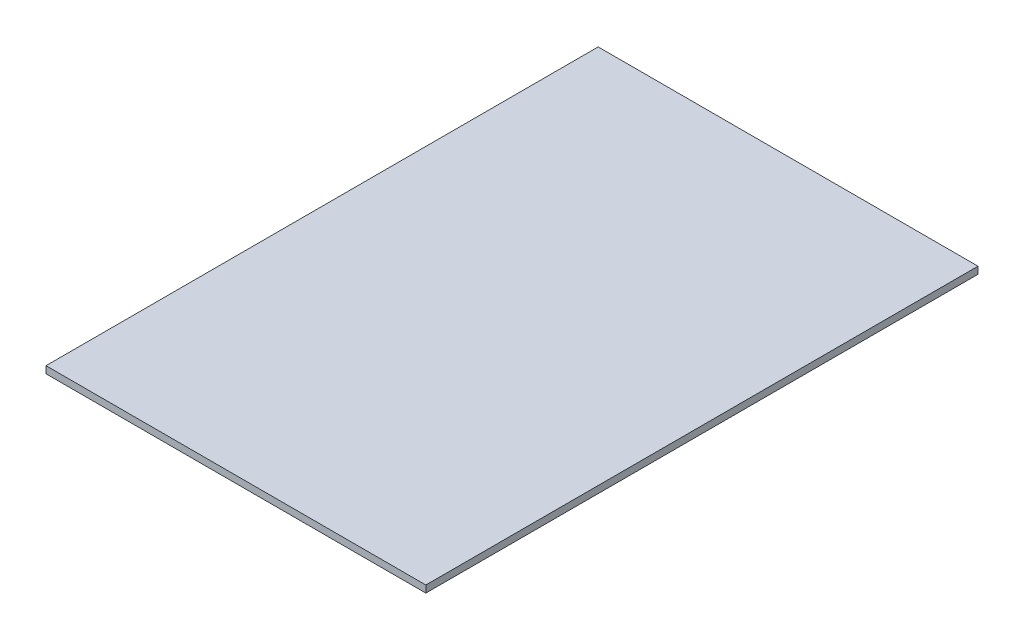
ISO-10303-21;
HEADER;
FILE_DESCRIPTION(('STEP AP214'),'2;1');
FILE_NAME('part.step','',(''),(''),'','','');
FILE_SCHEMA(('AUTOMOTIVE_DESIGN { 1 0 10303 214 1 1 1 1 }'));
ENDSEC;
DATA;
#1=APPLICATION_CONTEXT('core data for automotive mechanical design processes');
#2=APPLICATION_PROTOCOL_DEFINITION('international standard','automotive_design',2000,#1);
#3=PRODUCT_CONTEXT('',#1,'mechanical');
#4=PRODUCT('Part','Part','',(#3));
#5=PRODUCT_RELATED_PRODUCT_CATEGORY('part','',(#4));
#6=PRODUCT_DEFINITION_FORMATION('','',#4);
#7=PRODUCT_DEFINITION_CONTEXT('part definition',#1,'design');
#8=PRODUCT_DEFINITION('design','',#6,#7);
#9=PRODUCT_DEFINITION_SHAPE('','',#8);
#10=(LENGTH_UNIT() NAMED_UNIT(*) SI_UNIT(.MILLI.,.METRE.));
#11=(NAMED_UNIT(*) PLANE_ANGLE_UNIT() SI_UNIT($,.RADIAN.));
#12=(NAMED_UNIT(*) SI_UNIT($,.STERADIAN.) SOLID_ANGLE_UNIT());
#13=UNCERTAINTY_MEASURE_WITH_UNIT(LENGTH_MEASURE(1.E-05),#10,'distance_accuracy_value','');
#14=(GEOMETRIC_REPRESENTATION_CONTEXT(3) GLOBAL_UNCERTAINTY_ASSIGNED_CONTEXT((#13)) GLOBAL_UNIT_ASSIGNED_CONTEXT((#10,
#11,#12)) REPRESENTATION_CONTEXT('',''));
#15=CARTESIAN_POINT('',(0.,0.,0.));
#16=DIRECTION('',(0.,0.,1.));
#17=DIRECTION('',(1.,0.,0.));
#18=AXIS2_PLACEMENT_3D('',#15,#16,#17);
#19=CARTESIAN_POINT('',(-270.,10.,392.5));
#20=DIRECTION('',(0.,0.,-1.));
#21=DIRECTION('',(-1.,0.,0.));
#22=AXIS2_PLACEMENT_3D('',#19,#20,#21);
#23=PLANE('',#22);
#24=DIRECTION('',(1.,0.,0.));
#25=VECTOR('',#24,1.);
#26=CARTESIAN_POINT('',(-270.,0.,392.5));
#27=LINE('',#26,#25);
#28=CARTESIAN_POINT('',(-270.,0.,392.5));
#29=VERTEX_POINT('',#28);
#30=CARTESIAN_POINT('',(270.,0.,392.5));
#31=VERTEX_POINT('',#30);
#32=EDGE_CURVE('E98',#29,#31,#27,.T.);
#33=ORIENTED_EDGE('',*,*,#32,.T.);
#34=DIRECTION('',(0.,-1.,0.));
#35=VECTOR('',#34,1.);
#36=CARTESIAN_POINT('',(270.,10.,392.5));
#37=LINE('',#36,#35);
#38=CARTESIAN_POINT('',(270.,10.,392.5));
#39=VERTEX_POINT('',#38);
#40=EDGE_CURVE('E11',#39,#31,#37,.T.);
#41=ORIENTED_EDGE('',*,*,#40,.F.);
#42=DIRECTION('',(1.,0.,0.));
#43=VECTOR('',#42,1.);
#44=CARTESIAN_POINT('',(-270.,10.,392.5));
#45=LINE('',#44,#43);
#46=CARTESIAN_POINT('',(-270.,10.,392.5));
#47=VERTEX_POINT('',#46);
#48=EDGE_CURVE('E84',#47,#39,#45,.T.);
#49=ORIENTED_EDGE('',*,*,#48,.F.);
#50=DIRECTION('',(0.,-1.,0.));
#51=VECTOR('',#50,1.);
#52=CARTESIAN_POINT('',(-270.,10.,392.5));
#53=LINE('',#52,#51);
#54=EDGE_CURVE('E51',#47,#29,#53,.T.);
#55=ORIENTED_EDGE('',*,*,#54,.T.);
#56=EDGE_LOOP('',(#33,#41,#49,#55));
#57=FACE_BOUND('',#56,.T.);
#58=ADVANCED_FACE('F35',(#57),#23,.F.);
#59=CARTESIAN_POINT('',(270.,10.,392.5));
#60=DIRECTION('',(-1.,0.,0.));
#61=DIRECTION('',(0.,0.,1.));
#62=AXIS2_PLACEMENT_3D('',#59,#60,#61);
#63=PLANE('',#62);
#64=DIRECTION('',(0.,0.,-1.));
#65=VECTOR('',#64,1.);
#66=CARTESIAN_POINT('',(270.,0.,392.5));
#67=LINE('',#66,#65);
#68=CARTESIAN_POINT('',(270.,0.,-392.5));
#69=VERTEX_POINT('',#68);
#70=EDGE_CURVE('E89',#31,#69,#67,.T.);
#71=ORIENTED_EDGE('',*,*,#70,.T.);
#72=DIRECTION('',(0.,-1.,0.));
#73=VECTOR('',#72,1.);
#74=CARTESIAN_POINT('',(270.,10.,-392.5));
#75=LINE('',#74,#73);
#76=CARTESIAN_POINT('',(270.,10.,-392.5));
#77=VERTEX_POINT('',#76);
#78=EDGE_CURVE('E43',#77,#69,#75,.T.);
#79=ORIENTED_EDGE('',*,*,#78,.F.);
#80=DIRECTION('',(0.,0.,-1.));
#81=VECTOR('',#80,1.);
#82=CARTESIAN_POINT('',(270.,10.,392.5));
#83=LINE('',#82,#81);
#84=EDGE_CURVE('E76',#39,#77,#83,.T.);
#85=ORIENTED_EDGE('',*,*,#84,.F.);
#86=ORIENTED_EDGE('',*,*,#40,.T.);
#87=EDGE_LOOP('',(#71,#79,#85,#86));
#88=FACE_BOUND('',#87,.T.);
#89=ADVANCED_FACE('F88',(#88),#63,.F.);
#90=CARTESIAN_POINT('',(-270.,10.,-392.5));
#91=DIRECTION('',(0.,0.,-1.));
#92=DIRECTION('',(-1.,0.,0.));
#93=AXIS2_PLACEMENT_3D('',#90,#91,#92);
#94=PLANE('',#93);
#95=DIRECTION('',(1.,0.,0.));
#96=VECTOR('',#95,1.);
#97=CARTESIAN_POINT('',(-270.,0.,-392.5));
#98=LINE('',#97,#96);
#99=CARTESIAN_POINT('',(-270.,0.,-392.5));
#100=VERTEX_POINT('',#99);
#101=EDGE_CURVE('E101',#100,#69,#98,.T.);
#102=ORIENTED_EDGE('',*,*,#101,.F.);
#103=DIRECTION('',(0.,-1.,0.));
#104=VECTOR('',#103,1.);
#105=CARTESIAN_POINT('',(-270.,10.,-392.5));
#106=LINE('',#105,#104);
#107=CARTESIAN_POINT('',(-270.,10.,-392.5));
#108=VERTEX_POINT('',#107);
#109=EDGE_CURVE('E65',#108,#100,#106,.T.);
#110=ORIENTED_EDGE('',*,*,#109,.F.);
#111=DIRECTION('',(1.,0.,0.));
#112=VECTOR('',#111,1.);
#113=CARTESIAN_POINT('',(-270.,10.,-392.5));
#114=LINE('',#113,#112);
#115=EDGE_CURVE('E83',#108,#77,#114,.T.);
#116=ORIENTED_EDGE('',*,*,#115,.T.);
#117=ORIENTED_EDGE('',*,*,#78,.T.);
#118=EDGE_LOOP('',(#102,#110,#116,#117));
#119=FACE_BOUND('',#118,.T.);
#120=ADVANCED_FACE('F92',(#119),#94,.T.);
#121=CARTESIAN_POINT('',(-270.,10.,392.5));
#122=DIRECTION('',(-1.,0.,0.));
#123=DIRECTION('',(0.,0.,1.));
#124=AXIS2_PLACEMENT_3D('',#121,#122,#123);
#125=PLANE('',#124);
#126=DIRECTION('',(0.,0.,-1.));
#127=VECTOR('',#126,1.);
#128=CARTESIAN_POINT('',(-270.,0.,392.5));
#129=LINE('',#128,#127);
#130=EDGE_CURVE('E103',#29,#100,#129,.T.);
#131=ORIENTED_EDGE('',*,*,#130,.F.);
#132=ORIENTED_EDGE('',*,*,#54,.F.);
#133=DIRECTION('',(0.,0.,-1.));
#134=VECTOR('',#133,1.);
#135=CARTESIAN_POINT('',(-270.,10.,392.5));
#136=LINE('',#135,#134);
#137=EDGE_CURVE('E93',#47,#108,#136,.T.);
#138=ORIENTED_EDGE('',*,*,#137,.T.);
#139=ORIENTED_EDGE('',*,*,#109,.T.);
#140=EDGE_LOOP('',(#131,#132,#138,#139));
#141=FACE_BOUND('',#140,.T.);
#142=ADVANCED_FACE('F109',(#141),#125,.T.);
#143=CARTESIAN_POINT('',(0.,10.,0.));
#144=DIRECTION('',(0.,1.,0.));
#145=DIRECTION('',(0.,0.,1.));
#146=AXIS2_PLACEMENT_3D('',#143,#144,#145);
#147=PLANE('',#146);
#148=ORIENTED_EDGE('',*,*,#48,.T.);
#149=ORIENTED_EDGE('',*,*,#84,.T.);
#150=ORIENTED_EDGE('',*,*,#115,.F.);
#151=ORIENTED_EDGE('',*,*,#137,.F.);
#152=EDGE_LOOP('',(#148,#149,#150,#151));
#153=FACE_BOUND('',#152,.T.);
#154=ADVANCED_FACE('F80',(#153),#147,.T.);
#155=CARTESIAN_POINT('',(0.,0.,0.));
#156=DIRECTION('',(0.,1.,0.));
#157=DIRECTION('',(0.,0.,1.));
#158=AXIS2_PLACEMENT_3D('',#155,#156,#157);
#159=PLANE('',#158);
#160=ORIENTED_EDGE('',*,*,#32,.F.);
#161=ORIENTED_EDGE('',*,*,#130,.T.);
#162=ORIENTED_EDGE('',*,*,#101,.T.);
#163=ORIENTED_EDGE('',*,*,#70,.F.);
#164=EDGE_LOOP('',(#160,#161,#162,#163));
#165=FACE_BOUND('',#164,.T.);
#166=ADVANCED_FACE('F108',(#165),#159,.F.);
#167=CLOSED_SHELL('',(#58,#89,#120,#142,#154,#166));
#168=MANIFOLD_SOLID_BREP('B2',#167);
#169=ADVANCED_BREP_SHAPE_REPRESENTATION('',(#18,#168),#14);
#170=SHAPE_DEFINITION_REPRESENTATION(#9,#169);
ENDSEC;
END-ISO-10303-21;
